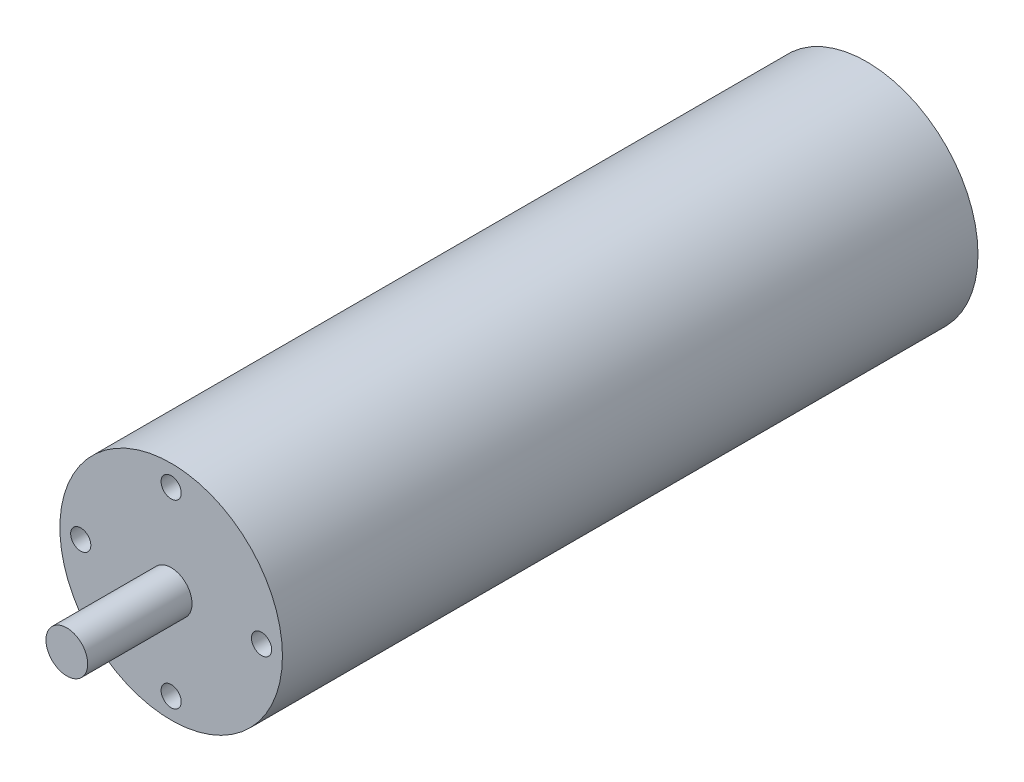
ISO-10303-21;
HEADER;
FILE_DESCRIPTION(('STEP AP214'),'2;1');
FILE_NAME('part.step','',(''),(''),'','','');
FILE_SCHEMA(('AUTOMOTIVE_DESIGN { 1 0 10303 214 1 1 1 1 }'));
ENDSEC;
DATA;
#1=APPLICATION_CONTEXT('core data for automotive mechanical design processes');
#2=APPLICATION_PROTOCOL_DEFINITION('international standard','automotive_design',2000,#1);
#3=PRODUCT_CONTEXT('',#1,'mechanical');
#4=PRODUCT('Part','Part','',(#3));
#5=PRODUCT_RELATED_PRODUCT_CATEGORY('part','',(#4));
#6=PRODUCT_DEFINITION_FORMATION('','',#4);
#7=PRODUCT_DEFINITION_CONTEXT('part definition',#1,'design');
#8=PRODUCT_DEFINITION('design','',#6,#7);
#9=PRODUCT_DEFINITION_SHAPE('','',#8);
#10=(LENGTH_UNIT() NAMED_UNIT(*) SI_UNIT(.MILLI.,.METRE.));
#11=(NAMED_UNIT(*) PLANE_ANGLE_UNIT() SI_UNIT($,.RADIAN.));
#12=(NAMED_UNIT(*) SI_UNIT($,.STERADIAN.) SOLID_ANGLE_UNIT());
#13=UNCERTAINTY_MEASURE_WITH_UNIT(LENGTH_MEASURE(1.E-05),#10,'distance_accuracy_value','');
#14=(GEOMETRIC_REPRESENTATION_CONTEXT(3) GLOBAL_UNCERTAINTY_ASSIGNED_CONTEXT((#13)) GLOBAL_UNIT_ASSIGNED_CONTEXT((#10,
#11,#12)) REPRESENTATION_CONTEXT('',''));
#15=CARTESIAN_POINT('',(0.,0.,0.));
#16=DIRECTION('',(0.,0.,1.));
#17=DIRECTION('',(1.,0.,0.));
#18=AXIS2_PLACEMENT_3D('',#15,#16,#17);
#19=CARTESIAN_POINT('',(0.,0.,100.));
#20=DIRECTION('',(0.,0.,-1.));
#21=DIRECTION('',(-1.,0.,0.));
#22=AXIS2_PLACEMENT_3D('',#19,#20,#21);
#23=CYLINDRICAL_SURFACE('',#22,16.);
#24=CARTESIAN_POINT('',(0.,0.,100.));
#25=DIRECTION('',(0.,0.,1.));
#26=DIRECTION('',(1.,0.,0.));
#27=AXIS2_PLACEMENT_3D('',#24,#25,#26);
#28=CIRCLE('',#27,16.);
#29=CARTESIAN_POINT('',(16.,0.,100.));
#30=VERTEX_POINT('',#29);
#31=EDGE_CURVE('E44',#30,#30,#28,.T.);
#32=ORIENTED_EDGE('',*,*,#31,.F.);
#33=EDGE_LOOP('',(#32));
#34=FACE_BOUND('',#33,.T.);
#35=CARTESIAN_POINT('',(0.,0.,0.));
#36=DIRECTION('',(0.,0.,1.));
#37=DIRECTION('',(1.,0.,0.));
#38=AXIS2_PLACEMENT_3D('',#35,#36,#37);
#39=CIRCLE('',#38,16.);
#40=CARTESIAN_POINT('',(16.,0.,0.));
#41=VERTEX_POINT('',#40);
#42=EDGE_CURVE('E39',#41,#41,#39,.T.);
#43=ORIENTED_EDGE('',*,*,#42,.T.);
#44=EDGE_LOOP('',(#43));
#45=FACE_BOUND('',#44,.T.);
#46=ADVANCED_FACE('F36',(#34,#45),#23,.T.);
#47=CARTESIAN_POINT('',(0.,0.,100.));
#48=DIRECTION('',(0.,0.,1.));
#49=DIRECTION('',(1.,0.,0.));
#50=AXIS2_PLACEMENT_3D('',#47,#48,#49);
#51=PLANE('',#50);
#52=CARTESIAN_POINT('',(13.,0.,100.));
#53=DIRECTION('',(0.,0.,1.));
#54=DIRECTION('',(0.,-1.,0.));
#55=AXIS2_PLACEMENT_3D('',#52,#53,#54);
#56=CIRCLE('',#55,1.45);
#57=CARTESIAN_POINT('',(13.,-1.45000000000004,100.));
#58=VERTEX_POINT('',#57);
#59=EDGE_CURVE('E243',#58,#58,#56,.T.);
#60=ORIENTED_EDGE('',*,*,#59,.F.);
#61=EDGE_LOOP('',(#60));
#62=FACE_BOUND('',#61,.T.);
#63=CARTESIAN_POINT('',(0.,-13.,100.));
#64=DIRECTION('',(0.,0.,1.));
#65=DIRECTION('',(-1.,0.,0.));
#66=AXIS2_PLACEMENT_3D('',#63,#64,#65);
#67=CIRCLE('',#66,1.45);
#68=CARTESIAN_POINT('',(-1.45,-13.,100.));
#69=VERTEX_POINT('',#68);
#70=EDGE_CURVE('E68',#69,#69,#67,.T.);
#71=ORIENTED_EDGE('',*,*,#70,.F.);
#72=EDGE_LOOP('',(#71));
#73=FACE_BOUND('',#72,.T.);
#74=CARTESIAN_POINT('',(-13.,1.36167772214882E-13,100.));
#75=DIRECTION('',(0.,0.,1.));
#76=DIRECTION('',(0.,1.,0.));
#77=AXIS2_PLACEMENT_3D('',#74,#75,#76);
#78=CIRCLE('',#77,1.45);
#79=CARTESIAN_POINT('',(-13.,1.45000000000014,100.));
#80=VERTEX_POINT('',#79);
#81=EDGE_CURVE('E69',#80,#80,#78,.T.);
#82=ORIENTED_EDGE('',*,*,#81,.F.);
#83=EDGE_LOOP('',(#82));
#84=FACE_BOUND('',#83,.T.);
#85=CARTESIAN_POINT('',(0.,13.,100.));
#86=DIRECTION('',(0.,0.,1.));
#87=DIRECTION('',(1.,0.,0.));
#88=AXIS2_PLACEMENT_3D('',#85,#86,#87);
#89=CIRCLE('',#88,1.45);
#90=CARTESIAN_POINT('',(1.45,13.,100.));
#91=VERTEX_POINT('',#90);
#92=EDGE_CURVE('E78',#91,#91,#89,.T.);
#93=ORIENTED_EDGE('',*,*,#92,.F.);
#94=EDGE_LOOP('',(#93));
#95=FACE_BOUND('',#94,.T.);
#96=CARTESIAN_POINT('',(0.,0.,100.));
#97=DIRECTION('',(0.,0.,1.));
#98=DIRECTION('',(1.,0.,0.));
#99=AXIS2_PLACEMENT_3D('',#96,#97,#98);
#100=CIRCLE('',#99,3.);
#101=CARTESIAN_POINT('',(3.,0.,100.));
#102=VERTEX_POINT('',#101);
#103=EDGE_CURVE('E11',#102,#102,#100,.T.);
#104=ORIENTED_EDGE('',*,*,#103,.F.);
#105=EDGE_LOOP('',(#104));
#106=FACE_BOUND('',#105,.T.);
#107=ORIENTED_EDGE('',*,*,#31,.T.);
#108=EDGE_LOOP('',(#107));
#109=FACE_BOUND('',#108,.T.);
#110=ADVANCED_FACE('F97',(#62,#73,#84,#95,#106,#109),#51,.T.);
#111=CARTESIAN_POINT('',(0.,0.,0.));
#112=DIRECTION('',(0.,0.,1.));
#113=DIRECTION('',(1.,0.,0.));
#114=AXIS2_PLACEMENT_3D('',#111,#112,#113);
#115=PLANE('',#114);
#116=ORIENTED_EDGE('',*,*,#42,.F.);
#117=EDGE_LOOP('',(#116));
#118=FACE_BOUND('',#117,.T.);
#119=ADVANCED_FACE('F94',(#118),#115,.F.);
#120=CARTESIAN_POINT('',(0.,0.,115.));
#121=DIRECTION('',(0.,0.,-1.));
#122=DIRECTION('',(-1.,0.,0.));
#123=AXIS2_PLACEMENT_3D('',#120,#121,#122);
#124=CYLINDRICAL_SURFACE('',#123,3.);
#125=CARTESIAN_POINT('',(0.,0.,115.));
#126=DIRECTION('',(0.,0.,1.));
#127=DIRECTION('',(1.,0.,0.));
#128=AXIS2_PLACEMENT_3D('',#125,#126,#127);
#129=CIRCLE('',#128,3.);
#130=CARTESIAN_POINT('',(3.,0.,115.));
#131=VERTEX_POINT('',#130);
#132=EDGE_CURVE('E85',#131,#131,#129,.T.);
#133=ORIENTED_EDGE('',*,*,#132,.F.);
#134=EDGE_LOOP('',(#133));
#135=FACE_BOUND('',#134,.T.);
#136=ORIENTED_EDGE('',*,*,#103,.T.);
#137=EDGE_LOOP('',(#136));
#138=FACE_BOUND('',#137,.T.);
#139=ADVANCED_FACE('F96',(#135,#138),#124,.T.);
#140=CARTESIAN_POINT('',(0.,0.,115.));
#141=DIRECTION('',(0.,0.,1.));
#142=DIRECTION('',(1.,0.,0.));
#143=AXIS2_PLACEMENT_3D('',#140,#141,#142);
#144=PLANE('',#143);
#145=ORIENTED_EDGE('',*,*,#132,.T.);
#146=EDGE_LOOP('',(#145));
#147=FACE_BOUND('',#146,.T.);
#148=ADVANCED_FACE('F102',(#147),#144,.T.);
#149=CARTESIAN_POINT('',(0.,13.,91.11));
#150=DIRECTION('',(0.,0.,1.));
#151=DIRECTION('',(1.,0.,0.));
#152=AXIS2_PLACEMENT_3D('',#149,#150,#151);
#153=CONICAL_SURFACE('',#152,1.45,1.02974425867665);
#154=CARTESIAN_POINT('',(0.,13.,90.23875210241));
#155=VERTEX_POINT('',#154);
#156=VERTEX_LOOP('',#155);
#157=FACE_BOUND('',#156,.T.);
#158=CARTESIAN_POINT('',(0.,13.,91.11));
#159=DIRECTION('',(0.,0.,1.));
#160=DIRECTION('',(1.,0.,0.));
#161=AXIS2_PLACEMENT_3D('',#158,#159,#160);
#162=CIRCLE('',#161,1.45);
#163=CARTESIAN_POINT('',(1.45,13.,91.11));
#164=VERTEX_POINT('',#163);
#165=EDGE_CURVE('E81',#164,#164,#162,.T.);
#166=ORIENTED_EDGE('',*,*,#165,.T.);
#167=EDGE_LOOP('',(#166));
#168=FACE_BOUND('',#167,.T.);
#169=ADVANCED_FACE('F194',(#157,#168),#153,.F.);
#170=CARTESIAN_POINT('',(0.,13.,100.));
#171=DIRECTION('',(0.,0.,1.));
#172=DIRECTION('',(1.,0.,0.));
#173=AXIS2_PLACEMENT_3D('',#170,#171,#172);
#174=CYLINDRICAL_SURFACE('',#173,1.45);
#175=ORIENTED_EDGE('',*,*,#165,.F.);
#176=EDGE_LOOP('',(#175));
#177=FACE_BOUND('',#176,.T.);
#178=ORIENTED_EDGE('',*,*,#92,.T.);
#179=EDGE_LOOP('',(#178));
#180=FACE_BOUND('',#179,.T.);
#181=ADVANCED_FACE('F62',(#177,#180),#174,.F.);
#182=CARTESIAN_POINT('',(-13.,1.36167772214882E-13,91.11));
#183=DIRECTION('',(0.,0.,1.));
#184=DIRECTION('',(0.,1.,0.));
#185=AXIS2_PLACEMENT_3D('',#182,#183,#184);
#186=CONICAL_SURFACE('',#185,1.45,1.02974425867665);
#187=CARTESIAN_POINT('',(-13.,1.33771319917569E-13,90.23875210241));
#188=VERTEX_POINT('',#187);
#189=VERTEX_LOOP('',#188);
#190=FACE_BOUND('',#189,.T.);
#191=CARTESIAN_POINT('',(-13.,1.36167772214882E-13,91.11));
#192=DIRECTION('',(0.,0.,1.));
#193=DIRECTION('',(0.,1.,0.));
#194=AXIS2_PLACEMENT_3D('',#191,#192,#193);
#195=CIRCLE('',#194,1.45);
#196=CARTESIAN_POINT('',(-13.,1.45000000000013,91.11));
#197=VERTEX_POINT('',#196);
#198=EDGE_CURVE('E66',#197,#197,#195,.T.);
#199=ORIENTED_EDGE('',*,*,#198,.T.);
#200=EDGE_LOOP('',(#199));
#201=FACE_BOUND('',#200,.T.);
#202=ADVANCED_FACE('F58',(#190,#201),#186,.F.);
#203=CARTESIAN_POINT('',(-13.,1.36167772214882E-13,100.));
#204=DIRECTION('',(0.,0.,1.));
#205=DIRECTION('',(0.,1.,0.));
#206=AXIS2_PLACEMENT_3D('',#203,#204,#205);
#207=CYLINDRICAL_SURFACE('',#206,1.45);
#208=ORIENTED_EDGE('',*,*,#198,.F.);
#209=EDGE_LOOP('',(#208));
#210=FACE_BOUND('',#209,.T.);
#211=ORIENTED_EDGE('',*,*,#81,.T.);
#212=EDGE_LOOP('',(#211));
#213=FACE_BOUND('',#212,.T.);
#214=ADVANCED_FACE('F61',(#210,#213),#207,.F.);
#215=CARTESIAN_POINT('',(0.,-13.,91.11));
#216=DIRECTION('',(0.,0.,1.));
#217=DIRECTION('',(-1.,0.,0.));
#218=AXIS2_PLACEMENT_3D('',#215,#216,#217);
#219=CONICAL_SURFACE('',#218,1.45,1.02974425867665);
#220=CARTESIAN_POINT('',(0.,-13.,90.23875210241));
#221=VERTEX_POINT('',#220);
#222=VERTEX_LOOP('',#221);
#223=FACE_BOUND('',#222,.T.);
#224=CARTESIAN_POINT('',(0.,-13.,91.11));
#225=DIRECTION('',(0.,0.,1.));
#226=DIRECTION('',(-1.,0.,0.));
#227=AXIS2_PLACEMENT_3D('',#224,#225,#226);
#228=CIRCLE('',#227,1.45);
#229=CARTESIAN_POINT('',(-1.45,-13.,91.11));
#230=VERTEX_POINT('',#229);
#231=EDGE_CURVE('E72',#230,#230,#228,.T.);
#232=ORIENTED_EDGE('',*,*,#231,.T.);
#233=EDGE_LOOP('',(#232));
#234=FACE_BOUND('',#233,.T.);
#235=ADVANCED_FACE('F140',(#223,#234),#219,.F.);
#236=CARTESIAN_POINT('',(0.,-13.,100.));
#237=DIRECTION('',(0.,0.,1.));
#238=DIRECTION('',(-1.,0.,0.));
#239=AXIS2_PLACEMENT_3D('',#236,#237,#238);
#240=CYLINDRICAL_SURFACE('',#239,1.45);
#241=ORIENTED_EDGE('',*,*,#231,.F.);
#242=EDGE_LOOP('',(#241));
#243=FACE_BOUND('',#242,.T.);
#244=ORIENTED_EDGE('',*,*,#70,.T.);
#245=EDGE_LOOP('',(#244));
#246=FACE_BOUND('',#245,.T.);
#247=ADVANCED_FACE('F151',(#243,#246),#240,.F.);
#248=CARTESIAN_POINT('',(13.,0.,91.11));
#249=DIRECTION('',(0.,0.,1.));
#250=DIRECTION('',(0.,-1.,0.));
#251=AXIS2_PLACEMENT_3D('',#248,#249,#250);
#252=CONICAL_SURFACE('',#251,1.45,1.02974425867665);
#253=CARTESIAN_POINT('',(13.,0.,90.23875210241));
#254=VERTEX_POINT('',#253);
#255=VERTEX_LOOP('',#254);
#256=FACE_BOUND('',#255,.T.);
#257=CARTESIAN_POINT('',(13.,0.,91.11));
#258=DIRECTION('',(0.,0.,1.));
#259=DIRECTION('',(0.,-1.,0.));
#260=AXIS2_PLACEMENT_3D('',#257,#258,#259);
#261=CIRCLE('',#260,1.45);
#262=CARTESIAN_POINT('',(13.,-1.45000000000004,91.11));
#263=VERTEX_POINT('',#262);
#264=EDGE_CURVE('E82',#263,#263,#261,.T.);
#265=ORIENTED_EDGE('',*,*,#264,.T.);
#266=EDGE_LOOP('',(#265));
#267=FACE_BOUND('',#266,.T.);
#268=ADVANCED_FACE('F161',(#256,#267),#252,.F.);
#269=CARTESIAN_POINT('',(13.,0.,100.));
#270=DIRECTION('',(0.,0.,1.));
#271=DIRECTION('',(0.,-1.,0.));
#272=AXIS2_PLACEMENT_3D('',#269,#270,#271);
#273=CYLINDRICAL_SURFACE('',#272,1.45);
#274=ORIENTED_EDGE('',*,*,#264,.F.);
#275=EDGE_LOOP('',(#274));
#276=FACE_BOUND('',#275,.T.);
#277=ORIENTED_EDGE('',*,*,#59,.T.);
#278=EDGE_LOOP('',(#277));
#279=FACE_BOUND('',#278,.T.);
#280=ADVANCED_FACE('F172',(#276,#279),#273,.F.);
#281=CLOSED_SHELL('',(#46,#110,#119,#139,#148,#169,#181,#202,#214,#235,#247,#268,#280));
#282=MANIFOLD_SOLID_BREP('B2',#281);
#283=ADVANCED_BREP_SHAPE_REPRESENTATION('',(#18,#282),#14);
#284=SHAPE_DEFINITION_REPRESENTATION(#9,#283);
ENDSEC;
END-ISO-10303-21;
